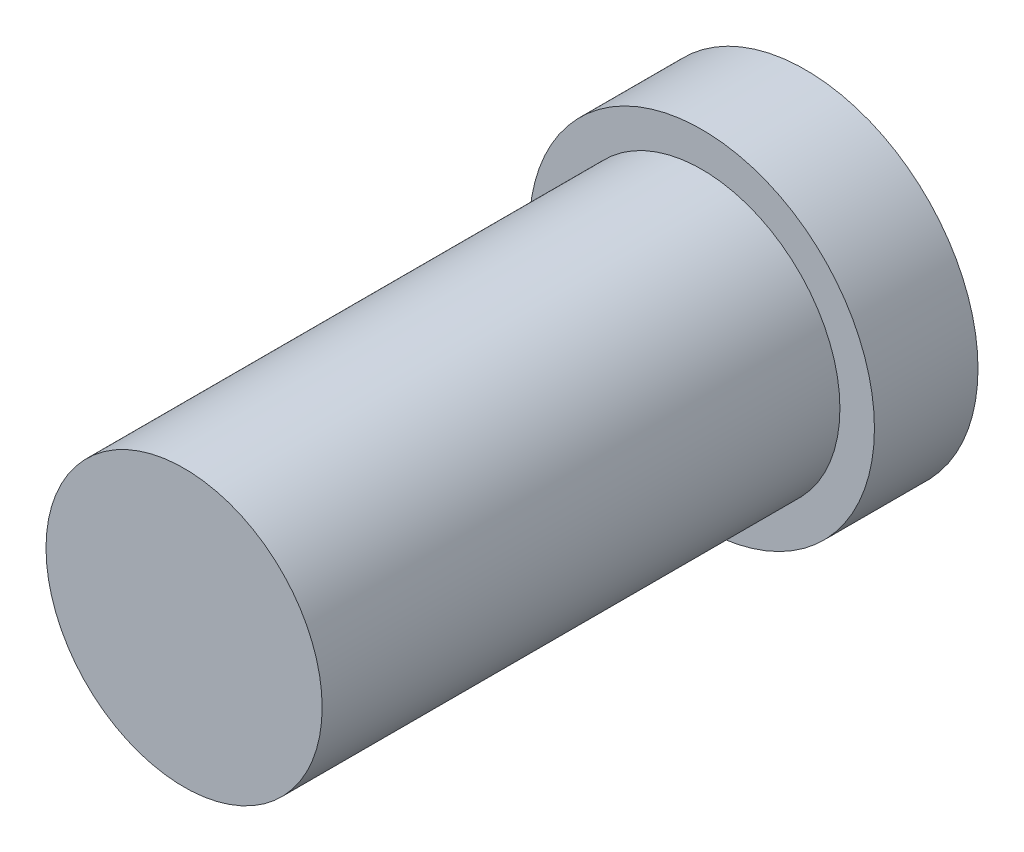
ISO-10303-21;
HEADER;
FILE_DESCRIPTION(('STEP AP214'),'2;1');
FILE_NAME('part.step','',(''),(''),'','','');
FILE_SCHEMA(('AUTOMOTIVE_DESIGN { 1 0 10303 214 1 1 1 1 }'));
ENDSEC;
DATA;
#1=APPLICATION_CONTEXT('core data for automotive mechanical design processes');
#2=APPLICATION_PROTOCOL_DEFINITION('international standard','automotive_design',2000,#1);
#3=PRODUCT_CONTEXT('',#1,'mechanical');
#4=PRODUCT('Part','Part','',(#3));
#5=PRODUCT_RELATED_PRODUCT_CATEGORY('part','',(#4));
#6=PRODUCT_DEFINITION_FORMATION('','',#4);
#7=PRODUCT_DEFINITION_CONTEXT('part definition',#1,'design');
#8=PRODUCT_DEFINITION('design','',#6,#7);
#9=PRODUCT_DEFINITION_SHAPE('','',#8);
#10=(LENGTH_UNIT() NAMED_UNIT(*) SI_UNIT(.MILLI.,.METRE.));
#11=(NAMED_UNIT(*) PLANE_ANGLE_UNIT() SI_UNIT($,.RADIAN.));
#12=(NAMED_UNIT(*) SI_UNIT($,.STERADIAN.) SOLID_ANGLE_UNIT());
#13=UNCERTAINTY_MEASURE_WITH_UNIT(LENGTH_MEASURE(1.E-05),#10,'distance_accuracy_value','');
#14=(GEOMETRIC_REPRESENTATION_CONTEXT(3) GLOBAL_UNCERTAINTY_ASSIGNED_CONTEXT((#13)) GLOBAL_UNIT_ASSIGNED_CONTEXT((#10,
#11,#12)) REPRESENTATION_CONTEXT('',''));
#15=CARTESIAN_POINT('',(0.,0.,0.));
#16=DIRECTION('',(0.,0.,1.));
#17=DIRECTION('',(1.,0.,0.));
#18=AXIS2_PLACEMENT_3D('',#15,#16,#17);
#19=CARTESIAN_POINT('',(0.,0.,3.));
#20=DIRECTION('',(0.,0.,-1.));
#21=DIRECTION('',(-1.,0.,0.));
#22=AXIS2_PLACEMENT_3D('',#19,#20,#21);
#23=CYLINDRICAL_SURFACE('',#22,5.);
#24=CARTESIAN_POINT('',(0.,0.,3.));
#25=DIRECTION('',(0.,0.,1.));
#26=DIRECTION('',(1.,0.,0.));
#27=AXIS2_PLACEMENT_3D('',#24,#25,#26);
#28=CIRCLE('',#27,5.);
#29=CARTESIAN_POINT('',(5.,0.,3.));
#30=VERTEX_POINT('',#29);
#31=EDGE_CURVE('E10',#30,#30,#28,.T.);
#32=ORIENTED_EDGE('',*,*,#31,.F.);
#33=EDGE_LOOP('',(#32));
#34=FACE_BOUND('',#33,.T.);
#35=CARTESIAN_POINT('',(0.,0.,0.));
#36=DIRECTION('',(0.,0.,1.));
#37=DIRECTION('',(1.,0.,0.));
#38=AXIS2_PLACEMENT_3D('',#35,#36,#37);
#39=CIRCLE('',#38,5.);
#40=CARTESIAN_POINT('',(5.,0.,0.));
#41=VERTEX_POINT('',#40);
#42=EDGE_CURVE('E34',#41,#41,#39,.T.);
#43=ORIENTED_EDGE('',*,*,#42,.T.);
#44=EDGE_LOOP('',(#43));
#45=FACE_BOUND('',#44,.T.);
#46=ADVANCED_FACE('F31',(#34,#45),#23,.T.);
#47=CARTESIAN_POINT('',(0.,0.,3.));
#48=DIRECTION('',(0.,0.,1.));
#49=DIRECTION('',(1.,0.,0.));
#50=AXIS2_PLACEMENT_3D('',#47,#48,#49);
#51=PLANE('',#50);
#52=CARTESIAN_POINT('',(0.,0.,3.));
#53=DIRECTION('',(0.,0.,1.));
#54=DIRECTION('',(1.,0.,0.));
#55=AXIS2_PLACEMENT_3D('',#52,#53,#54);
#56=CIRCLE('',#55,4.);
#57=CARTESIAN_POINT('',(4.,0.,3.));
#58=VERTEX_POINT('',#57);
#59=EDGE_CURVE('E43',#58,#58,#56,.T.);
#60=ORIENTED_EDGE('',*,*,#59,.F.);
#61=EDGE_LOOP('',(#60));
#62=FACE_BOUND('',#61,.T.);
#63=ORIENTED_EDGE('',*,*,#31,.T.);
#64=EDGE_LOOP('',(#63));
#65=FACE_BOUND('',#64,.T.);
#66=ADVANCED_FACE('F58',(#62,#65),#51,.T.);
#67=CARTESIAN_POINT('',(0.,0.,0.));
#68=DIRECTION('',(0.,0.,1.));
#69=DIRECTION('',(1.,0.,0.));
#70=AXIS2_PLACEMENT_3D('',#67,#68,#69);
#71=PLANE('',#70);
#72=ORIENTED_EDGE('',*,*,#42,.F.);
#73=EDGE_LOOP('',(#72));
#74=FACE_BOUND('',#73,.T.);
#75=ADVANCED_FACE('F54',(#74),#71,.F.);
#76=CARTESIAN_POINT('',(0.,0.,18.));
#77=DIRECTION('',(0.,0.,-1.));
#78=DIRECTION('',(-1.,0.,0.));
#79=AXIS2_PLACEMENT_3D('',#76,#77,#78);
#80=CYLINDRICAL_SURFACE('',#79,4.);
#81=CARTESIAN_POINT('',(0.,0.,18.));
#82=DIRECTION('',(0.,0.,1.));
#83=DIRECTION('',(1.,0.,0.));
#84=AXIS2_PLACEMENT_3D('',#81,#82,#83);
#85=CIRCLE('',#84,4.);
#86=CARTESIAN_POINT('',(4.,0.,18.));
#87=VERTEX_POINT('',#86);
#88=EDGE_CURVE('E41',#87,#87,#85,.T.);
#89=ORIENTED_EDGE('',*,*,#88,.F.);
#90=EDGE_LOOP('',(#89));
#91=FACE_BOUND('',#90,.T.);
#92=ORIENTED_EDGE('',*,*,#59,.T.);
#93=EDGE_LOOP('',(#92));
#94=FACE_BOUND('',#93,.T.);
#95=ADVANCED_FACE('F51',(#91,#94),#80,.T.);
#96=CARTESIAN_POINT('',(0.,0.,18.));
#97=DIRECTION('',(0.,0.,1.));
#98=DIRECTION('',(1.,0.,0.));
#99=AXIS2_PLACEMENT_3D('',#96,#97,#98);
#100=PLANE('',#99);
#101=ORIENTED_EDGE('',*,*,#88,.T.);
#102=EDGE_LOOP('',(#101));
#103=FACE_BOUND('',#102,.T.);
#104=ADVANCED_FACE('F49',(#103),#100,.T.);
#105=CLOSED_SHELL('',(#46,#66,#75,#95,#104));
#106=MANIFOLD_SOLID_BREP('B2',#105);
#107=ADVANCED_BREP_SHAPE_REPRESENTATION('',(#18,#106),#14);
#108=SHAPE_DEFINITION_REPRESENTATION(#9,#107);
ENDSEC;
END-ISO-10303-21;
